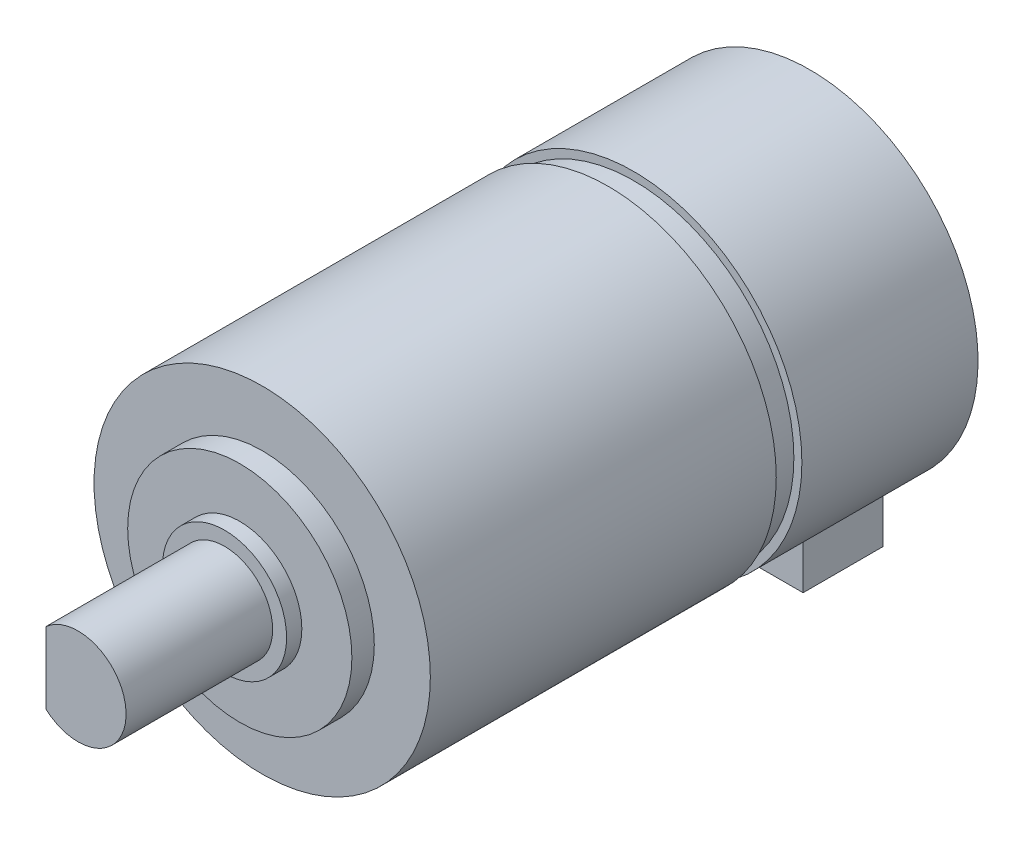
ISO-10303-21;
HEADER;
FILE_DESCRIPTION(('STEP AP214'),'2;1');
FILE_NAME('part.step','',(''),(''),'','','');
FILE_SCHEMA(('AUTOMOTIVE_DESIGN { 1 0 10303 214 1 1 1 1 }'));
ENDSEC;
DATA;
#1=APPLICATION_CONTEXT('core data for automotive mechanical design processes');
#2=APPLICATION_PROTOCOL_DEFINITION('international standard','automotive_design',2000,#1);
#3=PRODUCT_CONTEXT('',#1,'mechanical');
#4=PRODUCT('Part','Part','',(#3));
#5=PRODUCT_RELATED_PRODUCT_CATEGORY('part','',(#4));
#6=PRODUCT_DEFINITION_FORMATION('','',#4);
#7=PRODUCT_DEFINITION_CONTEXT('part definition',#1,'design');
#8=PRODUCT_DEFINITION('design','',#6,#7);
#9=PRODUCT_DEFINITION_SHAPE('','',#8);
#10=(LENGTH_UNIT() NAMED_UNIT(*) SI_UNIT(.MILLI.,.METRE.));
#11=(NAMED_UNIT(*) PLANE_ANGLE_UNIT() SI_UNIT($,.RADIAN.));
#12=(NAMED_UNIT(*) SI_UNIT($,.STERADIAN.) SOLID_ANGLE_UNIT());
#13=UNCERTAINTY_MEASURE_WITH_UNIT(LENGTH_MEASURE(1.E-05),#10,'distance_accuracy_value','');
#14=(GEOMETRIC_REPRESENTATION_CONTEXT(3) GLOBAL_UNCERTAINTY_ASSIGNED_CONTEXT((#13)) GLOBAL_UNIT_ASSIGNED_CONTEXT((#10,
#11,#12)) REPRESENTATION_CONTEXT('',''));
#15=CARTESIAN_POINT('',(0.,0.,0.));
#16=DIRECTION('',(0.,0.,1.));
#17=DIRECTION('',(1.,0.,0.));
#18=AXIS2_PLACEMENT_3D('',#15,#16,#17);
#19=CARTESIAN_POINT('',(0.,0.,22.));
#20=DIRECTION('',(0.,0.,-1.));
#21=DIRECTION('',(-1.,0.,0.));
#22=AXIS2_PLACEMENT_3D('',#19,#20,#21);
#23=CYLINDRICAL_SURFACE('',#22,21.);
#24=CARTESIAN_POINT('',(0.,0.,22.));
#25=DIRECTION('',(0.,0.,1.));
#26=DIRECTION('',(1.,0.,0.));
#27=AXIS2_PLACEMENT_3D('',#24,#25,#26);
#28=CIRCLE('',#27,21.);
#29=CARTESIAN_POINT('',(21.,0.,22.));
#30=VERTEX_POINT('',#29);
#31=EDGE_CURVE('E141',#30,#30,#28,.T.);
#32=ORIENTED_EDGE('',*,*,#31,.F.);
#33=EDGE_LOOP('',(#32));
#34=FACE_BOUND('',#33,.T.);
#35=DIRECTION('',(0.,0.,-1.));
#36=VECTOR('',#35,1.);
#37=CARTESIAN_POINT('',(-9.15,-18.9017856299345,10.));
#38=LINE('',#37,#36);
#39=CARTESIAN_POINT('',(-9.15,-18.9017856299345,10.));
#40=VERTEX_POINT('',#39);
#41=CARTESIAN_POINT('',(-9.15,-18.9017856299345,0.));
#42=VERTEX_POINT('',#41);
#43=EDGE_CURVE('E64',#40,#42,#38,.T.);
#44=ORIENTED_EDGE('',*,*,#43,.F.);
#45=CARTESIAN_POINT('',(0.,0.,10.));
#46=DIRECTION('',(0.,0.,-1.));
#47=DIRECTION('',(-1.,0.,0.));
#48=AXIS2_PLACEMENT_3D('',#45,#46,#47);
#49=CIRCLE('',#48,21.);
#50=CARTESIAN_POINT('',(9.15,-18.9017856299345,10.));
#51=VERTEX_POINT('',#50);
#52=EDGE_CURVE('E144',#51,#40,#49,.T.);
#53=ORIENTED_EDGE('',*,*,#52,.F.);
#54=DIRECTION('',(0.,0.,-1.));
#55=VECTOR('',#54,1.);
#56=CARTESIAN_POINT('',(9.15,-18.9017856299345,10.));
#57=LINE('',#56,#55);
#58=CARTESIAN_POINT('',(9.15,-18.9017856299345,0.));
#59=VERTEX_POINT('',#58);
#60=EDGE_CURVE('E164',#51,#59,#57,.T.);
#61=ORIENTED_EDGE('',*,*,#60,.T.);
#62=CARTESIAN_POINT('',(0.,0.,0.));
#63=DIRECTION('',(0.,0.,1.));
#64=DIRECTION('',(1.,0.,0.));
#65=AXIS2_PLACEMENT_3D('',#62,#63,#64);
#66=CIRCLE('',#65,21.);
#67=EDGE_CURVE('E44',#59,#42,#66,.T.);
#68=ORIENTED_EDGE('',*,*,#67,.T.);
#69=EDGE_LOOP('',(#44,#53,#61,#68));
#70=FACE_BOUND('',#69,.T.);
#71=ADVANCED_FACE('F41',(#34,#70),#23,.T.);
#72=CARTESIAN_POINT('',(0.,0.,22.));
#73=DIRECTION('',(0.,0.,1.));
#74=DIRECTION('',(1.,0.,0.));
#75=AXIS2_PLACEMENT_3D('',#72,#73,#74);
#76=PLANE('',#75);
#77=CARTESIAN_POINT('',(0.,0.,22.));
#78=DIRECTION('',(0.,0.,1.));
#79=DIRECTION('',(1.,0.,0.));
#80=AXIS2_PLACEMENT_3D('',#77,#78,#79);
#81=CIRCLE('',#80,20.);
#82=CARTESIAN_POINT('',(20.,0.,22.));
#83=VERTEX_POINT('',#82);
#84=EDGE_CURVE('E129',#83,#83,#81,.T.);
#85=ORIENTED_EDGE('',*,*,#84,.F.);
#86=EDGE_LOOP('',(#85));
#87=FACE_BOUND('',#86,.T.);
#88=ORIENTED_EDGE('',*,*,#31,.T.);
#89=EDGE_LOOP('',(#88));
#90=FACE_BOUND('',#89,.T.);
#91=ADVANCED_FACE('F199',(#87,#90),#76,.T.);
#92=CARTESIAN_POINT('',(0.,0.,0.));
#93=DIRECTION('',(0.,0.,1.));
#94=DIRECTION('',(1.,0.,0.));
#95=AXIS2_PLACEMENT_3D('',#92,#93,#94);
#96=PLANE('',#95);
#97=ORIENTED_EDGE('',*,*,#67,.F.);
#98=DIRECTION('',(0.,-1.,0.));
#99=VECTOR('',#98,1.);
#100=CARTESIAN_POINT('',(9.15,0.,0.));
#101=LINE('',#100,#99);
#102=CARTESIAN_POINT('',(9.15,-26.,0.));
#103=VERTEX_POINT('',#102);
#104=EDGE_CURVE('E155',#59,#103,#101,.T.);
#105=ORIENTED_EDGE('',*,*,#104,.T.);
#106=DIRECTION('',(-1.,0.,0.));
#107=VECTOR('',#106,1.);
#108=CARTESIAN_POINT('',(0.,-26.,0.));
#109=LINE('',#108,#107);
#110=CARTESIAN_POINT('',(-9.15,-26.,0.));
#111=VERTEX_POINT('',#110);
#112=EDGE_CURVE('E145',#103,#111,#109,.T.);
#113=ORIENTED_EDGE('',*,*,#112,.T.);
#114=DIRECTION('',(0.,-1.,0.));
#115=VECTOR('',#114,1.);
#116=CARTESIAN_POINT('',(-9.15,0.,0.));
#117=LINE('',#116,#115);
#118=EDGE_CURVE('E138',#42,#111,#117,.T.);
#119=ORIENTED_EDGE('',*,*,#118,.F.);
#120=EDGE_LOOP('',(#97,#105,#113,#119));
#121=FACE_BOUND('',#120,.T.);
#122=ADVANCED_FACE('F178',(#121),#96,.F.);
#123=CARTESIAN_POINT('',(-9.15,0.,10.));
#124=DIRECTION('',(1.,0.,0.));
#125=DIRECTION('',(0.,1.,0.));
#126=AXIS2_PLACEMENT_3D('',#123,#124,#125);
#127=PLANE('',#126);
#128=ORIENTED_EDGE('',*,*,#118,.T.);
#129=DIRECTION('',(0.,0.,-1.));
#130=VECTOR('',#129,1.);
#131=CARTESIAN_POINT('',(-9.15,-26.,10.));
#132=LINE('',#131,#130);
#133=CARTESIAN_POINT('',(-9.15,-26.,10.));
#134=VERTEX_POINT('',#133);
#135=EDGE_CURVE('E160',#134,#111,#132,.T.);
#136=ORIENTED_EDGE('',*,*,#135,.F.);
#137=DIRECTION('',(0.,-1.,0.));
#138=VECTOR('',#137,1.);
#139=CARTESIAN_POINT('',(-9.15,0.,10.));
#140=LINE('',#139,#138);
#141=EDGE_CURVE('E142',#40,#134,#140,.T.);
#142=ORIENTED_EDGE('',*,*,#141,.F.);
#143=ORIENTED_EDGE('',*,*,#43,.T.);
#144=EDGE_LOOP('',(#128,#136,#142,#143));
#145=FACE_BOUND('',#144,.T.);
#146=ADVANCED_FACE('F176',(#145),#127,.F.);
#147=CARTESIAN_POINT('',(0.,-26.,10.));
#148=DIRECTION('',(0.,-1.,0.));
#149=DIRECTION('',(0.,0.,-1.));
#150=AXIS2_PLACEMENT_3D('',#147,#148,#149);
#151=PLANE('',#150);
#152=ORIENTED_EDGE('',*,*,#112,.F.);
#153=DIRECTION('',(0.,0.,-1.));
#154=VECTOR('',#153,1.);
#155=CARTESIAN_POINT('',(9.15,-26.,10.));
#156=LINE('',#155,#154);
#157=CARTESIAN_POINT('',(9.15,-26.,10.));
#158=VERTEX_POINT('',#157);
#159=EDGE_CURVE('E162',#158,#103,#156,.T.);
#160=ORIENTED_EDGE('',*,*,#159,.F.);
#161=DIRECTION('',(-1.,0.,0.));
#162=VECTOR('',#161,1.);
#163=CARTESIAN_POINT('',(0.,-26.,10.));
#164=LINE('',#163,#162);
#165=EDGE_CURVE('E150',#158,#134,#164,.T.);
#166=ORIENTED_EDGE('',*,*,#165,.T.);
#167=ORIENTED_EDGE('',*,*,#135,.T.);
#168=EDGE_LOOP('',(#152,#160,#166,#167));
#169=FACE_BOUND('',#168,.T.);
#170=ADVANCED_FACE('F181',(#169),#151,.T.);
#171=CARTESIAN_POINT('',(9.15,0.,10.));
#172=DIRECTION('',(1.,0.,0.));
#173=DIRECTION('',(0.,1.,0.));
#174=AXIS2_PLACEMENT_3D('',#171,#172,#173);
#175=PLANE('',#174);
#176=ORIENTED_EDGE('',*,*,#104,.F.);
#177=ORIENTED_EDGE('',*,*,#60,.F.);
#178=DIRECTION('',(0.,-1.,0.));
#179=VECTOR('',#178,1.);
#180=CARTESIAN_POINT('',(9.15,0.,10.));
#181=LINE('',#180,#179);
#182=EDGE_CURVE('E147',#51,#158,#181,.T.);
#183=ORIENTED_EDGE('',*,*,#182,.T.);
#184=ORIENTED_EDGE('',*,*,#159,.T.);
#185=EDGE_LOOP('',(#176,#177,#183,#184));
#186=FACE_BOUND('',#185,.T.);
#187=ADVANCED_FACE('F187',(#186),#175,.T.);
#188=CARTESIAN_POINT('',(0.,0.,10.));
#189=DIRECTION('',(0.,0.,-1.));
#190=DIRECTION('',(-1.,0.,0.));
#191=AXIS2_PLACEMENT_3D('',#188,#189,#190);
#192=PLANE('',#191);
#193=ORIENTED_EDGE('',*,*,#141,.T.);
#194=ORIENTED_EDGE('',*,*,#165,.F.);
#195=ORIENTED_EDGE('',*,*,#182,.F.);
#196=ORIENTED_EDGE('',*,*,#52,.T.);
#197=EDGE_LOOP('',(#193,#194,#195,#196));
#198=FACE_BOUND('',#197,.T.);
#199=ADVANCED_FACE('F185',(#198),#192,.F.);
#200=CARTESIAN_POINT('',(0.,0.,25.2));
#201=DIRECTION('',(0.,0.,-1.));
#202=DIRECTION('',(-1.,0.,0.));
#203=AXIS2_PLACEMENT_3D('',#200,#201,#202);
#204=CYLINDRICAL_SURFACE('',#203,20.);
#205=CARTESIAN_POINT('',(0.,0.,25.2));
#206=DIRECTION('',(0.,0.,1.));
#207=DIRECTION('',(1.,0.,0.));
#208=AXIS2_PLACEMENT_3D('',#205,#206,#207);
#209=CIRCLE('',#208,20.);
#210=CARTESIAN_POINT('',(20.,0.,25.2));
#211=VERTEX_POINT('',#210);
#212=EDGE_CURVE('E133',#211,#211,#209,.T.);
#213=ORIENTED_EDGE('',*,*,#212,.F.);
#214=EDGE_LOOP('',(#213));
#215=FACE_BOUND('',#214,.T.);
#216=ORIENTED_EDGE('',*,*,#84,.T.);
#217=EDGE_LOOP('',(#216));
#218=FACE_BOUND('',#217,.T.);
#219=ADVANCED_FACE('F194',(#215,#218),#204,.T.);
#220=CARTESIAN_POINT('',(0.,0.,68.4));
#221=DIRECTION('',(0.,0.,-1.));
#222=DIRECTION('',(-1.,0.,0.));
#223=AXIS2_PLACEMENT_3D('',#220,#221,#222);
#224=CYLINDRICAL_SURFACE('',#223,21.);
#225=CARTESIAN_POINT('',(0.,0.,68.4));
#226=DIRECTION('',(0.,0.,1.));
#227=DIRECTION('',(1.,0.,0.));
#228=AXIS2_PLACEMENT_3D('',#225,#226,#227);
#229=CIRCLE('',#228,21.);
#230=CARTESIAN_POINT('',(21.,0.,68.4));
#231=VERTEX_POINT('',#230);
#232=EDGE_CURVE('E130',#231,#231,#229,.T.);
#233=ORIENTED_EDGE('',*,*,#232,.F.);
#234=EDGE_LOOP('',(#233));
#235=FACE_BOUND('',#234,.T.);
#236=CARTESIAN_POINT('',(0.,0.,25.2));
#237=DIRECTION('',(0.,0.,1.));
#238=DIRECTION('',(1.,0.,0.));
#239=AXIS2_PLACEMENT_3D('',#236,#237,#238);
#240=CIRCLE('',#239,21.);
#241=CARTESIAN_POINT('',(21.,0.,25.2));
#242=VERTEX_POINT('',#241);
#243=EDGE_CURVE('E126',#242,#242,#240,.T.);
#244=ORIENTED_EDGE('',*,*,#243,.T.);
#245=EDGE_LOOP('',(#244));
#246=FACE_BOUND('',#245,.T.);
#247=ADVANCED_FACE('F232',(#235,#246),#224,.T.);
#248=CARTESIAN_POINT('',(0.,0.,68.4));
#249=DIRECTION('',(0.,0.,1.));
#250=DIRECTION('',(1.,0.,0.));
#251=AXIS2_PLACEMENT_3D('',#248,#249,#250);
#252=PLANE('',#251);
#253=CARTESIAN_POINT('',(0.,0.,68.4));
#254=DIRECTION('',(0.,0.,1.));
#255=DIRECTION('',(1.,0.,0.));
#256=AXIS2_PLACEMENT_3D('',#253,#254,#255);
#257=CIRCLE('',#256,14.);
#258=CARTESIAN_POINT('',(14.,0.,68.4));
#259=VERTEX_POINT('',#258);
#260=EDGE_CURVE('E123',#259,#259,#257,.T.);
#261=ORIENTED_EDGE('',*,*,#260,.F.);
#262=EDGE_LOOP('',(#261));
#263=FACE_BOUND('',#262,.T.);
#264=ORIENTED_EDGE('',*,*,#232,.T.);
#265=EDGE_LOOP('',(#264));
#266=FACE_BOUND('',#265,.T.);
#267=ADVANCED_FACE('F240',(#263,#266),#252,.T.);
#268=CARTESIAN_POINT('',(0.,0.,25.2));
#269=DIRECTION('',(0.,0.,1.));
#270=DIRECTION('',(1.,0.,0.));
#271=AXIS2_PLACEMENT_3D('',#268,#269,#270);
#272=PLANE('',#271);
#273=ORIENTED_EDGE('',*,*,#212,.T.);
#274=EDGE_LOOP('',(#273));
#275=FACE_BOUND('',#274,.T.);
#276=ORIENTED_EDGE('',*,*,#243,.F.);
#277=EDGE_LOOP('',(#276));
#278=FACE_BOUND('',#277,.T.);
#279=ADVANCED_FACE('F249',(#275,#278),#272,.F.);
#280=CARTESIAN_POINT('',(0.,0.,71.2));
#281=DIRECTION('',(0.,0.,-1.));
#282=DIRECTION('',(-1.,0.,0.));
#283=AXIS2_PLACEMENT_3D('',#280,#281,#282);
#284=CYLINDRICAL_SURFACE('',#283,14.);
#285=CARTESIAN_POINT('',(0.,0.,71.2));
#286=DIRECTION('',(0.,0.,1.));
#287=DIRECTION('',(1.,0.,0.));
#288=AXIS2_PLACEMENT_3D('',#285,#286,#287);
#289=CIRCLE('',#288,14.);
#290=CARTESIAN_POINT('',(14.,0.,71.2));
#291=VERTEX_POINT('',#290);
#292=EDGE_CURVE('E120',#291,#291,#289,.T.);
#293=ORIENTED_EDGE('',*,*,#292,.F.);
#294=EDGE_LOOP('',(#293));
#295=FACE_BOUND('',#294,.T.);
#296=ORIENTED_EDGE('',*,*,#260,.T.);
#297=EDGE_LOOP('',(#296));
#298=FACE_BOUND('',#297,.T.);
#299=ADVANCED_FACE('F257',(#295,#298),#284,.T.);
#300=CARTESIAN_POINT('',(0.,0.,71.2));
#301=DIRECTION('',(0.,0.,1.));
#302=DIRECTION('',(1.,0.,0.));
#303=AXIS2_PLACEMENT_3D('',#300,#301,#302);
#304=PLANE('',#303);
#305=CARTESIAN_POINT('',(0.,0.,71.2));
#306=DIRECTION('',(0.,0.,1.));
#307=DIRECTION('',(1.,0.,0.));
#308=AXIS2_PLACEMENT_3D('',#305,#306,#307);
#309=CIRCLE('',#308,7.75);
#310=CARTESIAN_POINT('',(7.75,0.,71.2));
#311=VERTEX_POINT('',#310);
#312=EDGE_CURVE('E49',#311,#311,#309,.T.);
#313=ORIENTED_EDGE('',*,*,#312,.F.);
#314=EDGE_LOOP('',(#313));
#315=FACE_BOUND('',#314,.T.);
#316=ORIENTED_EDGE('',*,*,#292,.T.);
#317=EDGE_LOOP('',(#316));
#318=FACE_BOUND('',#317,.T.);
#319=ADVANCED_FACE('F264',(#315,#318),#304,.T.);
#320=CARTESIAN_POINT('',(0.,0.,73.1));
#321=DIRECTION('',(0.,0.,-1.));
#322=DIRECTION('',(-1.,0.,0.));
#323=AXIS2_PLACEMENT_3D('',#320,#321,#322);
#324=CYLINDRICAL_SURFACE('',#323,7.75);
#325=CARTESIAN_POINT('',(0.,0.,73.1));
#326=DIRECTION('',(0.,0.,1.));
#327=DIRECTION('',(1.,0.,0.));
#328=AXIS2_PLACEMENT_3D('',#325,#326,#327);
#329=CIRCLE('',#328,7.75);
#330=CARTESIAN_POINT('',(7.75,0.,73.1));
#331=VERTEX_POINT('',#330);
#332=EDGE_CURVE('E113',#331,#331,#329,.T.);
#333=ORIENTED_EDGE('',*,*,#332,.F.);
#334=EDGE_LOOP('',(#333));
#335=FACE_BOUND('',#334,.T.);
#336=ORIENTED_EDGE('',*,*,#312,.T.);
#337=EDGE_LOOP('',(#336));
#338=FACE_BOUND('',#337,.T.);
#339=ADVANCED_FACE('F272',(#335,#338),#324,.T.);
#340=CARTESIAN_POINT('',(0.,0.,73.1));
#341=DIRECTION('',(0.,0.,1.));
#342=DIRECTION('',(1.,0.,0.));
#343=AXIS2_PLACEMENT_3D('',#340,#341,#342);
#344=PLANE('',#343);
#345=CARTESIAN_POINT('',(0.,0.,73.1));
#346=DIRECTION('',(0.,0.,1.));
#347=DIRECTION('',(1.,0.,0.));
#348=AXIS2_PLACEMENT_3D('',#345,#346,#347);
#349=CIRCLE('',#348,6.);
#350=CARTESIAN_POINT('',(6.,0.,73.1));
#351=VERTEX_POINT('',#350);
#352=EDGE_CURVE('E11',#351,#351,#349,.T.);
#353=ORIENTED_EDGE('',*,*,#352,.F.);
#354=EDGE_LOOP('',(#353));
#355=FACE_BOUND('',#354,.T.);
#356=ORIENTED_EDGE('',*,*,#332,.T.);
#357=EDGE_LOOP('',(#356));
#358=FACE_BOUND('',#357,.T.);
#359=ADVANCED_FACE('F280',(#355,#358),#344,.T.);
#360=CARTESIAN_POINT('',(0.,0.,80.9));
#361=DIRECTION('',(0.,0.,-1.));
#362=DIRECTION('',(-1.,0.,0.));
#363=AXIS2_PLACEMENT_3D('',#360,#361,#362);
#364=CYLINDRICAL_SURFACE('',#363,6.);
#365=CARTESIAN_POINT('',(0.,0.,80.9));
#366=DIRECTION('',(0.,0.,1.));
#367=DIRECTION('',(1.,0.,0.));
#368=AXIS2_PLACEMENT_3D('',#365,#366,#367);
#369=CIRCLE('',#368,6.);
#370=CARTESIAN_POINT('',(-4.,4.47213595499958,80.9));
#371=VERTEX_POINT('',#370);
#372=CARTESIAN_POINT('',(-4.,-4.47213595499958,80.9));
#373=VERTEX_POINT('',#372);
#374=EDGE_CURVE('E111',#371,#373,#369,.T.);
#375=ORIENTED_EDGE('',*,*,#374,.F.);
#376=DIRECTION('',(0.,0.,-1.));
#377=VECTOR('',#376,1.);
#378=CARTESIAN_POINT('',(-4.,4.47213595499958,91.4));
#379=LINE('',#378,#377);
#380=CARTESIAN_POINT('',(-4.,4.47213595499958,91.4));
#381=VERTEX_POINT('',#380);
#382=EDGE_CURVE('E99',#381,#371,#379,.T.);
#383=ORIENTED_EDGE('',*,*,#382,.F.);
#384=CARTESIAN_POINT('',(0.,0.,91.4));
#385=DIRECTION('',(0.,0.,1.));
#386=DIRECTION('',(1.,0.,0.));
#387=AXIS2_PLACEMENT_3D('',#384,#385,#386);
#388=CIRCLE('',#387,6.);
#389=CARTESIAN_POINT('',(-4.,-4.47213595499958,91.4));
#390=VERTEX_POINT('',#389);
#391=EDGE_CURVE('E104',#390,#381,#388,.T.);
#392=ORIENTED_EDGE('',*,*,#391,.F.);
#393=DIRECTION('',(0.,0.,-1.));
#394=VECTOR('',#393,1.);
#395=CARTESIAN_POINT('',(-4.,-4.47213595499958,91.4));
#396=LINE('',#395,#394);
#397=EDGE_CURVE('E101',#390,#373,#396,.T.);
#398=ORIENTED_EDGE('',*,*,#397,.T.);
#399=EDGE_LOOP('',(#375,#383,#392,#398));
#400=FACE_BOUND('',#399,.T.);
#401=ORIENTED_EDGE('',*,*,#352,.T.);
#402=EDGE_LOOP('',(#401));
#403=FACE_BOUND('',#402,.T.);
#404=ADVANCED_FACE('F109',(#400,#403),#364,.T.);
#405=CARTESIAN_POINT('',(0.,0.,80.9));
#406=DIRECTION('',(0.,0.,1.));
#407=DIRECTION('',(1.,0.,0.));
#408=AXIS2_PLACEMENT_3D('',#405,#406,#407);
#409=PLANE('',#408);
#410=DIRECTION('',(0.,-1.,0.));
#411=VECTOR('',#410,1.);
#412=CARTESIAN_POINT('',(-4.,0.,80.9));
#413=LINE('',#412,#411);
#414=EDGE_CURVE('E56',#371,#373,#413,.T.);
#415=ORIENTED_EDGE('',*,*,#414,.F.);
#416=ORIENTED_EDGE('',*,*,#374,.T.);
#417=EDGE_LOOP('',(#415,#416));
#418=FACE_BOUND('',#417,.T.);
#419=ADVANCED_FACE('F296',(#418),#409,.T.);
#420=CARTESIAN_POINT('',(-4.,0.,91.4));
#421=DIRECTION('',(1.,0.,0.));
#422=DIRECTION('',(0.,1.,0.));
#423=AXIS2_PLACEMENT_3D('',#420,#421,#422);
#424=PLANE('',#423);
#425=ORIENTED_EDGE('',*,*,#414,.T.);
#426=ORIENTED_EDGE('',*,*,#397,.F.);
#427=DIRECTION('',(0.,-1.,0.));
#428=VECTOR('',#427,1.);
#429=CARTESIAN_POINT('',(-4.,0.,91.4));
#430=LINE('',#429,#428);
#431=EDGE_CURVE('E95',#381,#390,#430,.T.);
#432=ORIENTED_EDGE('',*,*,#431,.F.);
#433=ORIENTED_EDGE('',*,*,#382,.T.);
#434=EDGE_LOOP('',(#425,#426,#432,#433));
#435=FACE_BOUND('',#434,.T.);
#436=ADVANCED_FACE('F97',(#435),#424,.F.);
#437=CARTESIAN_POINT('',(0.,0.,91.4));
#438=DIRECTION('',(0.,0.,1.));
#439=DIRECTION('',(1.,0.,0.));
#440=AXIS2_PLACEMENT_3D('',#437,#438,#439);
#441=PLANE('',#440);
#442=ORIENTED_EDGE('',*,*,#391,.T.);
#443=ORIENTED_EDGE('',*,*,#431,.T.);
#444=EDGE_LOOP('',(#442,#443));
#445=FACE_BOUND('',#444,.T.);
#446=ADVANCED_FACE('F106',(#445),#441,.T.);
#447=CLOSED_SHELL('',(#71,#91,#122,#146,#170,#187,#199,#219,#247,#267,#279,#299,#319,#339,#359,
#404,#419,#436,#446));
#448=MANIFOLD_SOLID_BREP('B2',#447);
#449=ADVANCED_BREP_SHAPE_REPRESENTATION('',(#18,#448),#14);
#450=SHAPE_DEFINITION_REPRESENTATION(#9,#449);
ENDSEC;
END-ISO-10303-21;
